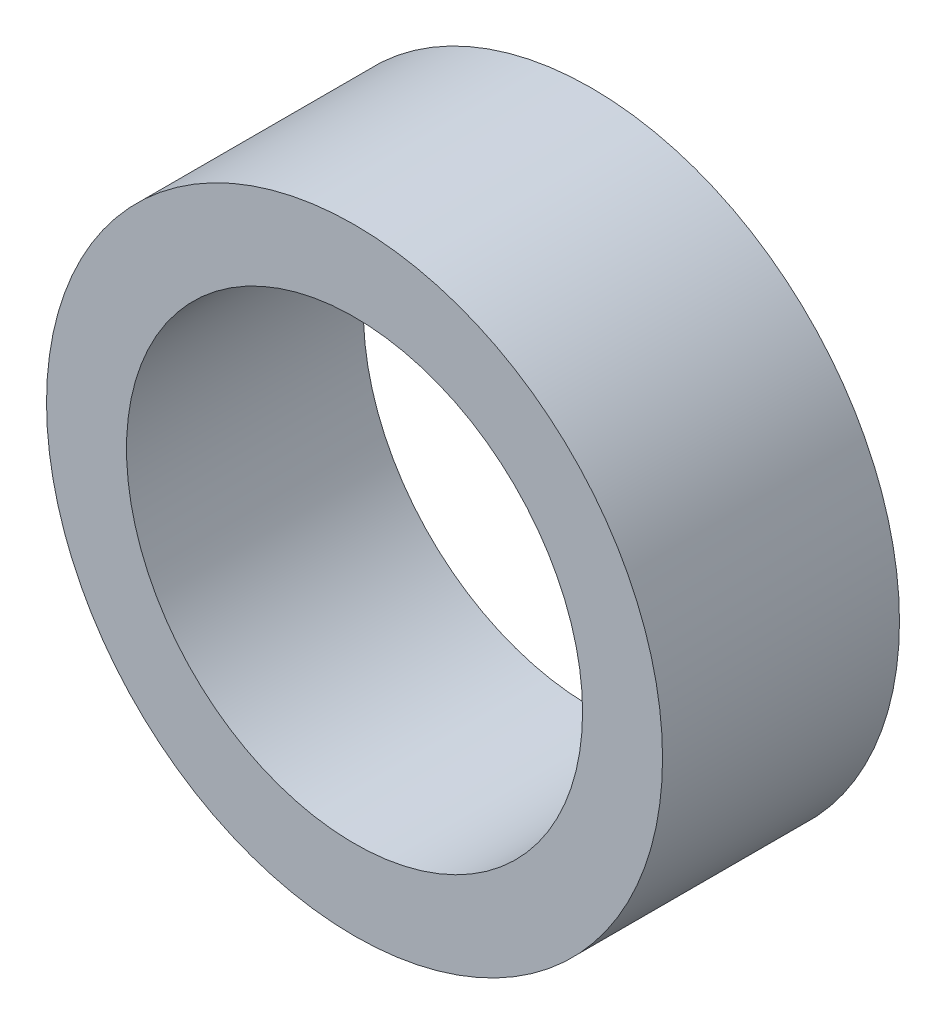
ISO-10303-21;
HEADER;
FILE_DESCRIPTION(('STEP AP214'),'2;1');
FILE_NAME('part.step','',(''),(''),'','','');
FILE_SCHEMA(('AUTOMOTIVE_DESIGN { 1 0 10303 214 1 1 1 1 }'));
ENDSEC;
DATA;
#1=APPLICATION_CONTEXT('core data for automotive mechanical design processes');
#2=APPLICATION_PROTOCOL_DEFINITION('international standard','automotive_design',2000,#1);
#3=PRODUCT_CONTEXT('',#1,'mechanical');
#4=PRODUCT('Part','Part','',(#3));
#5=PRODUCT_RELATED_PRODUCT_CATEGORY('part','',(#4));
#6=PRODUCT_DEFINITION_FORMATION('','',#4);
#7=PRODUCT_DEFINITION_CONTEXT('part definition',#1,'design');
#8=PRODUCT_DEFINITION('design','',#6,#7);
#9=PRODUCT_DEFINITION_SHAPE('','',#8);
#10=(LENGTH_UNIT() NAMED_UNIT(*) SI_UNIT(.MILLI.,.METRE.));
#11=(NAMED_UNIT(*) PLANE_ANGLE_UNIT() SI_UNIT($,.RADIAN.));
#12=(NAMED_UNIT(*) SI_UNIT($,.STERADIAN.) SOLID_ANGLE_UNIT());
#13=UNCERTAINTY_MEASURE_WITH_UNIT(LENGTH_MEASURE(1.E-05),#10,'distance_accuracy_value','');
#14=(GEOMETRIC_REPRESENTATION_CONTEXT(3) GLOBAL_UNCERTAINTY_ASSIGNED_CONTEXT((#13)) GLOBAL_UNIT_ASSIGNED_CONTEXT((#10,
#11,#12)) REPRESENTATION_CONTEXT('',''));
#15=CARTESIAN_POINT('',(0.,0.,0.));
#16=DIRECTION('',(0.,0.,1.));
#17=DIRECTION('',(1.,0.,0.));
#18=AXIS2_PLACEMENT_3D('',#15,#16,#17);
#19=CARTESIAN_POINT('',(0.,0.,5.));
#20=DIRECTION('',(0.,0.,-1.));
#21=DIRECTION('',(-1.,0.,0.));
#22=AXIS2_PLACEMENT_3D('',#19,#20,#21);
#23=CYLINDRICAL_SURFACE('',#22,6.5);
#24=CARTESIAN_POINT('',(0.,0.,5.));
#25=DIRECTION('',(0.,0.,1.));
#26=DIRECTION('',(1.,0.,0.));
#27=AXIS2_PLACEMENT_3D('',#24,#25,#26);
#28=CIRCLE('',#27,6.5);
#29=CARTESIAN_POINT('',(6.5,0.,5.));
#30=VERTEX_POINT('',#29);
#31=EDGE_CURVE('E10',#30,#30,#28,.T.);
#32=ORIENTED_EDGE('',*,*,#31,.F.);
#33=EDGE_LOOP('',(#32));
#34=FACE_BOUND('',#33,.T.);
#35=CARTESIAN_POINT('',(0.,0.,0.));
#36=DIRECTION('',(0.,0.,1.));
#37=DIRECTION('',(1.,0.,0.));
#38=AXIS2_PLACEMENT_3D('',#35,#36,#37);
#39=CIRCLE('',#38,6.5);
#40=CARTESIAN_POINT('',(6.5,0.,0.));
#41=VERTEX_POINT('',#40);
#42=EDGE_CURVE('E38',#41,#41,#39,.T.);
#43=ORIENTED_EDGE('',*,*,#42,.T.);
#44=EDGE_LOOP('',(#43));
#45=FACE_BOUND('',#44,.T.);
#46=ADVANCED_FACE('F35',(#34,#45),#23,.T.);
#47=CARTESIAN_POINT('',(0.,0.,5.));
#48=DIRECTION('',(0.,0.,1.));
#49=DIRECTION('',(1.,0.,0.));
#50=AXIS2_PLACEMENT_3D('',#47,#48,#49);
#51=PLANE('',#50);
#52=CARTESIAN_POINT('',(0.,0.,5.));
#53=DIRECTION('',(0.,0.,1.));
#54=DIRECTION('',(1.,0.,0.));
#55=AXIS2_PLACEMENT_3D('',#52,#53,#54);
#56=CIRCLE('',#55,4.8125);
#57=CARTESIAN_POINT('',(4.8125,0.,5.));
#58=VERTEX_POINT('',#57);
#59=EDGE_CURVE('E50',#58,#58,#56,.T.);
#60=ORIENTED_EDGE('',*,*,#59,.F.);
#61=EDGE_LOOP('',(#60));
#62=FACE_BOUND('',#61,.T.);
#63=ORIENTED_EDGE('',*,*,#31,.T.);
#64=EDGE_LOOP('',(#63));
#65=FACE_BOUND('',#64,.T.);
#66=ADVANCED_FACE('F68',(#62,#65),#51,.T.);
#67=CARTESIAN_POINT('',(0.,0.,0.));
#68=DIRECTION('',(0.,0.,1.));
#69=DIRECTION('',(1.,0.,0.));
#70=AXIS2_PLACEMENT_3D('',#67,#68,#69);
#71=PLANE('',#70);
#72=CARTESIAN_POINT('',(0.,0.,0.));
#73=DIRECTION('',(0.,0.,1.));
#74=DIRECTION('',(1.,0.,0.));
#75=AXIS2_PLACEMENT_3D('',#72,#73,#74);
#76=CIRCLE('',#75,4.8125);
#77=CARTESIAN_POINT('',(4.8125,0.,0.));
#78=VERTEX_POINT('',#77);
#79=EDGE_CURVE('E48',#78,#78,#76,.T.);
#80=ORIENTED_EDGE('',*,*,#79,.T.);
#81=EDGE_LOOP('',(#80));
#82=FACE_BOUND('',#81,.T.);
#83=ORIENTED_EDGE('',*,*,#42,.F.);
#84=EDGE_LOOP('',(#83));
#85=FACE_BOUND('',#84,.T.);
#86=ADVANCED_FACE('F59',(#82,#85),#71,.F.);
#87=CARTESIAN_POINT('',(0.,0.,0.));
#88=DIRECTION('',(0.,0.,1.));
#89=DIRECTION('',(1.,0.,0.));
#90=AXIS2_PLACEMENT_3D('',#87,#88,#89);
#91=CYLINDRICAL_SURFACE('',#90,4.8125);
#92=ORIENTED_EDGE('',*,*,#79,.F.);
#93=EDGE_LOOP('',(#92));
#94=FACE_BOUND('',#93,.T.);
#95=ORIENTED_EDGE('',*,*,#59,.T.);
#96=EDGE_LOOP('',(#95));
#97=FACE_BOUND('',#96,.T.);
#98=ADVANCED_FACE('F62',(#94,#97),#91,.F.);
#99=CLOSED_SHELL('',(#46,#66,#86,#98));
#100=MANIFOLD_SOLID_BREP('B2',#99);
#101=ADVANCED_BREP_SHAPE_REPRESENTATION('',(#18,#100),#14);
#102=SHAPE_DEFINITION_REPRESENTATION(#9,#101);
ENDSEC;
END-ISO-10303-21;
